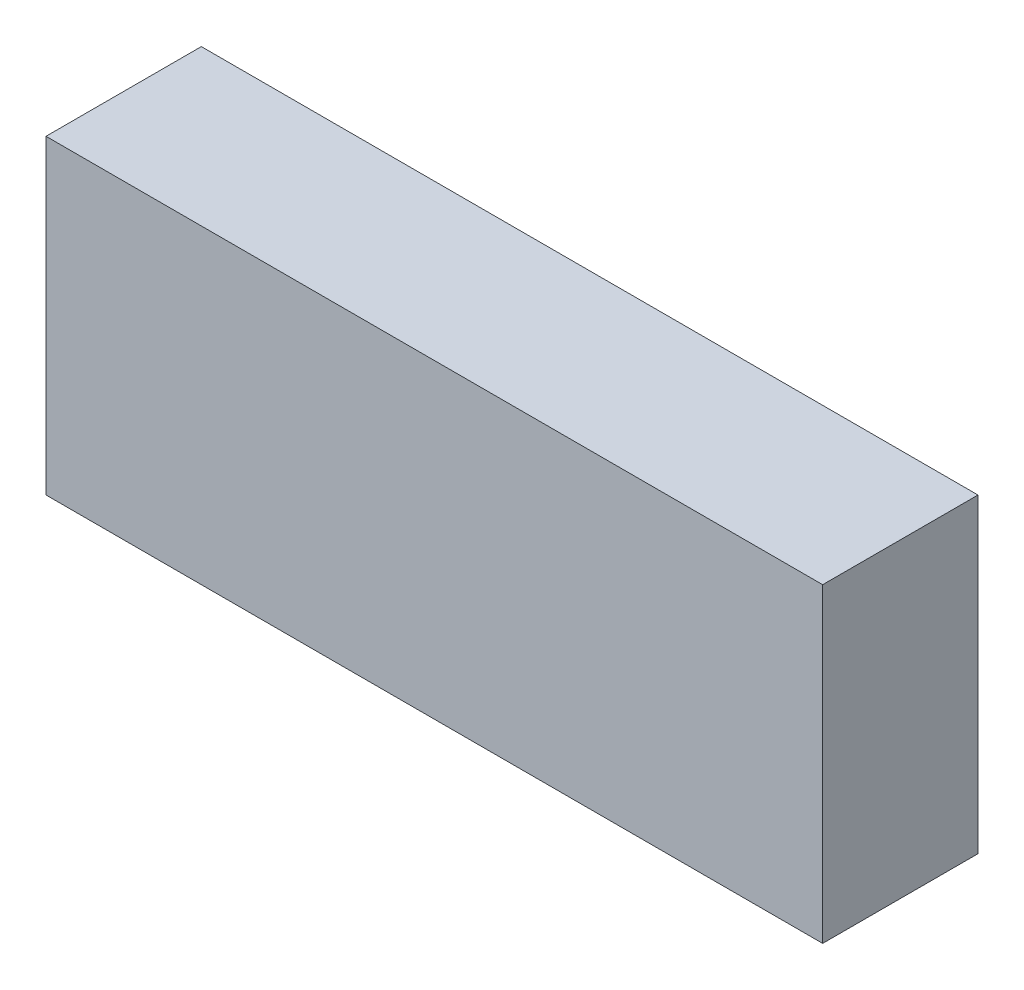
ISO-10303-21;
HEADER;
FILE_DESCRIPTION(('STEP AP214'),'2;1');
FILE_NAME('part.step','',(''),(''),'','','');
FILE_SCHEMA(('AUTOMOTIVE_DESIGN { 1 0 10303 214 1 1 1 1 }'));
ENDSEC;
DATA;
#1=APPLICATION_CONTEXT('core data for automotive mechanical design processes');
#2=APPLICATION_PROTOCOL_DEFINITION('international standard','automotive_design',2000,#1);
#3=PRODUCT_CONTEXT('',#1,'mechanical');
#4=PRODUCT('Part','Part','',(#3));
#5=PRODUCT_RELATED_PRODUCT_CATEGORY('part','',(#4));
#6=PRODUCT_DEFINITION_FORMATION('','',#4);
#7=PRODUCT_DEFINITION_CONTEXT('part definition',#1,'design');
#8=PRODUCT_DEFINITION('design','',#6,#7);
#9=PRODUCT_DEFINITION_SHAPE('','',#8);
#10=(LENGTH_UNIT() NAMED_UNIT(*) SI_UNIT(.MILLI.,.METRE.));
#11=(NAMED_UNIT(*) PLANE_ANGLE_UNIT() SI_UNIT($,.RADIAN.));
#12=(NAMED_UNIT(*) SI_UNIT($,.STERADIAN.) SOLID_ANGLE_UNIT());
#13=UNCERTAINTY_MEASURE_WITH_UNIT(LENGTH_MEASURE(1.E-05),#10,'distance_accuracy_value','');
#14=(GEOMETRIC_REPRESENTATION_CONTEXT(3) GLOBAL_UNCERTAINTY_ASSIGNED_CONTEXT((#13)) GLOBAL_UNIT_ASSIGNED_CONTEXT((#10,
#11,#12)) REPRESENTATION_CONTEXT('',''));
#15=CARTESIAN_POINT('',(0.,0.,0.));
#16=DIRECTION('',(0.,0.,1.));
#17=DIRECTION('',(1.,0.,0.));
#18=AXIS2_PLACEMENT_3D('',#15,#16,#17);
#19=CARTESIAN_POINT('',(25.,10.,10.));
#20=DIRECTION('',(-1.,0.,0.));
#21=DIRECTION('',(0.,-1.,0.));
#22=AXIS2_PLACEMENT_3D('',#19,#20,#21);
#23=PLANE('',#22);
#24=DIRECTION('',(0.,1.,0.));
#25=VECTOR('',#24,1.);
#26=CARTESIAN_POINT('',(25.,10.,0.));
#27=LINE('',#26,#25);
#28=CARTESIAN_POINT('',(25.,-10.,0.));
#29=VERTEX_POINT('',#28);
#30=CARTESIAN_POINT('',(25.,10.,0.));
#31=VERTEX_POINT('',#30);
#32=EDGE_CURVE('E96',#29,#31,#27,.T.);
#33=ORIENTED_EDGE('',*,*,#32,.T.);
#34=DIRECTION('',(0.,0.,-1.));
#35=VECTOR('',#34,1.);
#36=CARTESIAN_POINT('',(25.,10.,10.));
#37=LINE('',#36,#35);
#38=CARTESIAN_POINT('',(25.,10.,10.));
#39=VERTEX_POINT('',#38);
#40=EDGE_CURVE('E11',#39,#31,#37,.T.);
#41=ORIENTED_EDGE('',*,*,#40,.F.);
#42=DIRECTION('',(0.,1.,0.));
#43=VECTOR('',#42,1.);
#44=CARTESIAN_POINT('',(25.,10.,10.));
#45=LINE('',#44,#43);
#46=CARTESIAN_POINT('',(25.,-10.,10.));
#47=VERTEX_POINT('',#46);
#48=EDGE_CURVE('E84',#47,#39,#45,.T.);
#49=ORIENTED_EDGE('',*,*,#48,.F.);
#50=DIRECTION('',(0.,0.,-1.));
#51=VECTOR('',#50,1.);
#52=CARTESIAN_POINT('',(25.,-10.,10.));
#53=LINE('',#52,#51);
#54=EDGE_CURVE('E92',#47,#29,#53,.T.);
#55=ORIENTED_EDGE('',*,*,#54,.T.);
#56=EDGE_LOOP('',(#33,#41,#49,#55));
#57=FACE_BOUND('',#56,.T.);
#58=ADVANCED_FACE('F33',(#57),#23,.F.);
#59=CARTESIAN_POINT('',(-25.,10.,10.));
#60=DIRECTION('',(0.,-1.,0.));
#61=DIRECTION('',(0.,0.,-1.));
#62=AXIS2_PLACEMENT_3D('',#59,#60,#61);
#63=PLANE('',#62);
#64=DIRECTION('',(-1.,0.,0.));
#65=VECTOR('',#64,1.);
#66=CARTESIAN_POINT('',(-25.,10.,0.));
#67=LINE('',#66,#65);
#68=CARTESIAN_POINT('',(-25.,10.,0.));
#69=VERTEX_POINT('',#68);
#70=EDGE_CURVE('E88',#31,#69,#67,.T.);
#71=ORIENTED_EDGE('',*,*,#70,.T.);
#72=DIRECTION('',(0.,0.,-1.));
#73=VECTOR('',#72,1.);
#74=CARTESIAN_POINT('',(-25.,10.,10.));
#75=LINE('',#74,#73);
#76=CARTESIAN_POINT('',(-25.,10.,10.));
#77=VERTEX_POINT('',#76);
#78=EDGE_CURVE('E41',#77,#69,#75,.T.);
#79=ORIENTED_EDGE('',*,*,#78,.F.);
#80=DIRECTION('',(-1.,0.,0.));
#81=VECTOR('',#80,1.);
#82=CARTESIAN_POINT('',(-25.,10.,10.));
#83=LINE('',#82,#81);
#84=EDGE_CURVE('E79',#39,#77,#83,.T.);
#85=ORIENTED_EDGE('',*,*,#84,.F.);
#86=ORIENTED_EDGE('',*,*,#40,.T.);
#87=EDGE_LOOP('',(#71,#79,#85,#86));
#88=FACE_BOUND('',#87,.T.);
#89=ADVANCED_FACE('F87',(#88),#63,.F.);
#90=CARTESIAN_POINT('',(-25.,10.,10.));
#91=DIRECTION('',(1.,0.,0.));
#92=DIRECTION('',(0.,0.,-1.));
#93=AXIS2_PLACEMENT_3D('',#90,#91,#92);
#94=PLANE('',#93);
#95=DIRECTION('',(0.,-1.,0.));
#96=VECTOR('',#95,1.);
#97=CARTESIAN_POINT('',(-25.,10.,0.));
#98=LINE('',#97,#96);
#99=CARTESIAN_POINT('',(-25.,-10.,0.));
#100=VERTEX_POINT('',#99);
#101=EDGE_CURVE('E66',#69,#100,#98,.T.);
#102=ORIENTED_EDGE('',*,*,#101,.T.);
#103=DIRECTION('',(0.,0.,-1.));
#104=VECTOR('',#103,1.);
#105=CARTESIAN_POINT('',(-25.,-10.,10.));
#106=LINE('',#105,#104);
#107=CARTESIAN_POINT('',(-25.,-10.,10.));
#108=VERTEX_POINT('',#107);
#109=EDGE_CURVE('E89',#108,#100,#106,.T.);
#110=ORIENTED_EDGE('',*,*,#109,.F.);
#111=DIRECTION('',(0.,-1.,0.));
#112=VECTOR('',#111,1.);
#113=CARTESIAN_POINT('',(-25.,10.,10.));
#114=LINE('',#113,#112);
#115=EDGE_CURVE('E82',#77,#108,#114,.T.);
#116=ORIENTED_EDGE('',*,*,#115,.F.);
#117=ORIENTED_EDGE('',*,*,#78,.T.);
#118=EDGE_LOOP('',(#102,#110,#116,#117));
#119=FACE_BOUND('',#118,.T.);
#120=ADVANCED_FACE('F90',(#119),#94,.F.);
#121=CARTESIAN_POINT('',(-25.,-10.,10.));
#122=DIRECTION('',(0.,1.,0.));
#123=DIRECTION('',(0.,0.,1.));
#124=AXIS2_PLACEMENT_3D('',#121,#122,#123);
#125=PLANE('',#124);
#126=DIRECTION('',(1.,0.,0.));
#127=VECTOR('',#126,1.);
#128=CARTESIAN_POINT('',(-25.,-10.,0.));
#129=LINE('',#128,#127);
#130=EDGE_CURVE('E72',#100,#29,#129,.T.);
#131=ORIENTED_EDGE('',*,*,#130,.T.);
#132=ORIENTED_EDGE('',*,*,#54,.F.);
#133=DIRECTION('',(1.,0.,0.));
#134=VECTOR('',#133,1.);
#135=CARTESIAN_POINT('',(-25.,-10.,10.));
#136=LINE('',#135,#134);
#137=EDGE_CURVE('E49',#108,#47,#136,.T.);
#138=ORIENTED_EDGE('',*,*,#137,.F.);
#139=ORIENTED_EDGE('',*,*,#109,.T.);
#140=EDGE_LOOP('',(#131,#132,#138,#139));
#141=FACE_BOUND('',#140,.T.);
#142=ADVANCED_FACE('F103',(#141),#125,.F.);
#143=CARTESIAN_POINT('',(0.,0.,10.));
#144=DIRECTION('',(0.,0.,1.));
#145=DIRECTION('',(1.,0.,0.));
#146=AXIS2_PLACEMENT_3D('',#143,#144,#145);
#147=PLANE('',#146);
#148=ORIENTED_EDGE('',*,*,#48,.T.);
#149=ORIENTED_EDGE('',*,*,#84,.T.);
#150=ORIENTED_EDGE('',*,*,#115,.T.);
#151=ORIENTED_EDGE('',*,*,#137,.T.);
#152=EDGE_LOOP('',(#148,#149,#150,#151));
#153=FACE_BOUND('',#152,.T.);
#154=ADVANCED_FACE('F80',(#153),#147,.T.);
#155=CARTESIAN_POINT('',(0.,0.,0.));
#156=DIRECTION('',(0.,0.,1.));
#157=DIRECTION('',(1.,0.,0.));
#158=AXIS2_PLACEMENT_3D('',#155,#156,#157);
#159=PLANE('',#158);
#160=ORIENTED_EDGE('',*,*,#32,.F.);
#161=ORIENTED_EDGE('',*,*,#130,.F.);
#162=ORIENTED_EDGE('',*,*,#101,.F.);
#163=ORIENTED_EDGE('',*,*,#70,.F.);
#164=EDGE_LOOP('',(#160,#161,#162,#163));
#165=FACE_BOUND('',#164,.T.);
#166=ADVANCED_FACE('F106',(#165),#159,.F.);
#167=CLOSED_SHELL('',(#58,#89,#120,#142,#154,#166));
#168=MANIFOLD_SOLID_BREP('B2',#167);
#169=ADVANCED_BREP_SHAPE_REPRESENTATION('',(#18,#168),#14);
#170=SHAPE_DEFINITION_REPRESENTATION(#9,#169);
ENDSEC;
END-ISO-10303-21;
